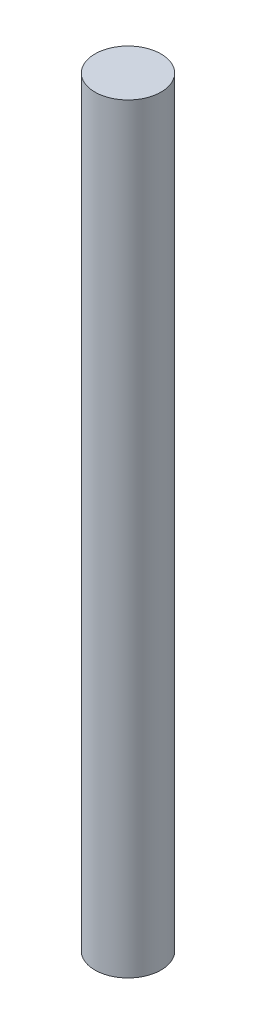
ISO-10303-21;
HEADER;
FILE_DESCRIPTION(('STEP AP214'),'2;1');
FILE_NAME('part.step','',(''),(''),'','','');
FILE_SCHEMA(('AUTOMOTIVE_DESIGN { 1 0 10303 214 1 1 1 1 }'));
ENDSEC;
DATA;
#1=APPLICATION_CONTEXT('core data for automotive mechanical design processes');
#2=APPLICATION_PROTOCOL_DEFINITION('international standard','automotive_design',2000,#1);
#3=PRODUCT_CONTEXT('',#1,'mechanical');
#4=PRODUCT('Part','Part','',(#3));
#5=PRODUCT_RELATED_PRODUCT_CATEGORY('part','',(#4));
#6=PRODUCT_DEFINITION_FORMATION('','',#4);
#7=PRODUCT_DEFINITION_CONTEXT('part definition',#1,'design');
#8=PRODUCT_DEFINITION('design','',#6,#7);
#9=PRODUCT_DEFINITION_SHAPE('','',#8);
#10=(LENGTH_UNIT() NAMED_UNIT(*) SI_UNIT(.MILLI.,.METRE.));
#11=(NAMED_UNIT(*) PLANE_ANGLE_UNIT() SI_UNIT($,.RADIAN.));
#12=(NAMED_UNIT(*) SI_UNIT($,.STERADIAN.) SOLID_ANGLE_UNIT());
#13=UNCERTAINTY_MEASURE_WITH_UNIT(LENGTH_MEASURE(1.E-05),#10,'distance_accuracy_value','');
#14=(GEOMETRIC_REPRESENTATION_CONTEXT(3) GLOBAL_UNCERTAINTY_ASSIGNED_CONTEXT((#13)) GLOBAL_UNIT_ASSIGNED_CONTEXT((#10,
#11,#12)) REPRESENTATION_CONTEXT('',''));
#15=CARTESIAN_POINT('',(0.,0.,0.));
#16=DIRECTION('',(0.,0.,1.));
#17=DIRECTION('',(1.,0.,0.));
#18=AXIS2_PLACEMENT_3D('',#15,#16,#17);
#19=CARTESIAN_POINT('',(0.,23.,0.));
#20=DIRECTION('',(0.,-1.,0.));
#21=DIRECTION('',(0.,0.,-1.));
#22=AXIS2_PLACEMENT_3D('',#19,#20,#21);
#23=CYLINDRICAL_SURFACE('',#22,1.);
#24=CARTESIAN_POINT('',(0.,23.,0.));
#25=DIRECTION('',(0.,1.,0.));
#26=DIRECTION('',(0.,0.,1.));
#27=AXIS2_PLACEMENT_3D('',#24,#25,#26);
#28=CIRCLE('',#27,1.);
#29=CARTESIAN_POINT('',(0.,23.,1.));
#30=VERTEX_POINT('',#29);
#31=EDGE_CURVE('E10',#30,#30,#28,.T.);
#32=ORIENTED_EDGE('',*,*,#31,.F.);
#33=EDGE_LOOP('',(#32));
#34=FACE_BOUND('',#33,.T.);
#35=CARTESIAN_POINT('',(0.,0.,0.));
#36=DIRECTION('',(0.,1.,0.));
#37=DIRECTION('',(0.,0.,1.));
#38=AXIS2_PLACEMENT_3D('',#35,#36,#37);
#39=CIRCLE('',#38,1.);
#40=CARTESIAN_POINT('',(0.,0.,1.));
#41=VERTEX_POINT('',#40);
#42=EDGE_CURVE('E35',#41,#41,#39,.T.);
#43=ORIENTED_EDGE('',*,*,#42,.T.);
#44=EDGE_LOOP('',(#43));
#45=FACE_BOUND('',#44,.T.);
#46=ADVANCED_FACE('F32',(#34,#45),#23,.T.);
#47=CARTESIAN_POINT('',(0.,23.,0.));
#48=DIRECTION('',(0.,1.,0.));
#49=DIRECTION('',(0.,0.,1.));
#50=AXIS2_PLACEMENT_3D('',#47,#48,#49);
#51=PLANE('',#50);
#52=ORIENTED_EDGE('',*,*,#31,.T.);
#53=EDGE_LOOP('',(#52));
#54=FACE_BOUND('',#53,.T.);
#55=ADVANCED_FACE('F47',(#54),#51,.T.);
#56=CARTESIAN_POINT('',(0.,0.,0.));
#57=DIRECTION('',(0.,1.,0.));
#58=DIRECTION('',(0.,0.,1.));
#59=AXIS2_PLACEMENT_3D('',#56,#57,#58);
#60=PLANE('',#59);
#61=ORIENTED_EDGE('',*,*,#42,.F.);
#62=EDGE_LOOP('',(#61));
#63=FACE_BOUND('',#62,.T.);
#64=ADVANCED_FACE('F45',(#63),#60,.F.);
#65=CLOSED_SHELL('',(#46,#55,#64));
#66=MANIFOLD_SOLID_BREP('B2',#65);
#67=ADVANCED_BREP_SHAPE_REPRESENTATION('',(#18,#66),#14);
#68=SHAPE_DEFINITION_REPRESENTATION(#9,#67);
ENDSEC;
END-ISO-10303-21;
